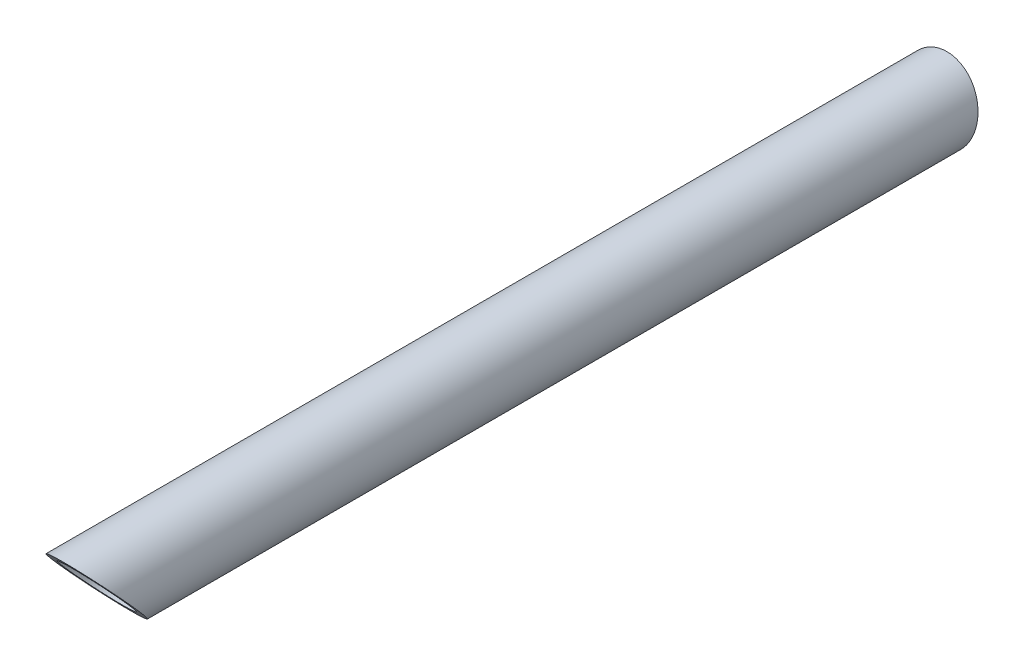
ISO-10303-21;
HEADER;
FILE_DESCRIPTION(('STEP AP214'),'2;1');
FILE_NAME('part.step','',(''),(''),'','','');
FILE_SCHEMA(('AUTOMOTIVE_DESIGN { 1 0 10303 214 1 1 1 1 }'));
ENDSEC;
DATA;
#1=APPLICATION_CONTEXT('core data for automotive mechanical design processes');
#2=APPLICATION_PROTOCOL_DEFINITION('international standard','automotive_design',2000,#1);
#3=PRODUCT_CONTEXT('',#1,'mechanical');
#4=PRODUCT('Part','Part','',(#3));
#5=PRODUCT_RELATED_PRODUCT_CATEGORY('part','',(#4));
#6=PRODUCT_DEFINITION_FORMATION('','',#4);
#7=PRODUCT_DEFINITION_CONTEXT('part definition',#1,'design');
#8=PRODUCT_DEFINITION('design','',#6,#7);
#9=PRODUCT_DEFINITION_SHAPE('','',#8);
#10=(LENGTH_UNIT() NAMED_UNIT(*) SI_UNIT(.MILLI.,.METRE.));
#11=(NAMED_UNIT(*) PLANE_ANGLE_UNIT() SI_UNIT($,.RADIAN.));
#12=(NAMED_UNIT(*) SI_UNIT($,.STERADIAN.) SOLID_ANGLE_UNIT());
#13=UNCERTAINTY_MEASURE_WITH_UNIT(LENGTH_MEASURE(1.E-05),#10,'distance_accuracy_value','');
#14=(GEOMETRIC_REPRESENTATION_CONTEXT(3) GLOBAL_UNCERTAINTY_ASSIGNED_CONTEXT((#13)) GLOBAL_UNIT_ASSIGNED_CONTEXT((#10,
#11,#12)) REPRESENTATION_CONTEXT('',''));
#15=CARTESIAN_POINT('',(0.,0.,0.));
#16=DIRECTION('',(0.,0.,1.));
#17=DIRECTION('',(1.,0.,0.));
#18=AXIS2_PLACEMENT_3D('',#15,#16,#17);
#19=CARTESIAN_POINT('',(0.,0.,0.));
#20=DIRECTION('',(0.,0.,1.));
#21=DIRECTION('',(-1.,0.,0.));
#22=AXIS2_PLACEMENT_3D('',#19,#20,#21);
#23=CYLINDRICAL_SURFACE('',#22,10.65);
#24=CARTESIAN_POINT('',(0.,0.,236.37445000171));
#25=DIRECTION('',(0.,0.66412219582778,-0.747624042556744));
#26=DIRECTION('',(0.,-0.747624042556744,-0.66412219582778));
#27=AXIS2_PLACEMENT_3D('',#24,#25,#26);
#28=ELLIPSE('',#27,14.2451277564307,10.65);
#29=CARTESIAN_POINT('',(0.,10.65,245.834955527158));
#30=VERTEX_POINT('',#29);
#31=EDGE_CURVE('E11',#30,#30,#28,.T.);
#32=ORIENTED_EDGE('',*,*,#31,.T.);
#33=EDGE_LOOP('',(#32));
#34=FACE_BOUND('',#33,.T.);
#35=CARTESIAN_POINT('',(0.,0.,0.));
#36=DIRECTION('',(-0.00211206155957193,0.196299401175255,0.980541730011632));
#37=DIRECTION('',(-0.0105494190073639,0.980484979004172,-0.196310763092081));
#38=AXIS2_PLACEMENT_3D('',#35,#36,#37);
#39=ELLIPSE('',#38,10.8613429434295,10.65);
#40=CARTESIAN_POINT('',(0.114580857692914,-10.6493836078456,2.13219852142941));
#41=VERTEX_POINT('',#40);
#42=EDGE_CURVE('E50',#41,#41,#39,.T.);
#43=ORIENTED_EDGE('',*,*,#42,.T.);
#44=EDGE_LOOP('',(#43));
#45=FACE_BOUND('',#44,.T.);
#46=ADVANCED_FACE('F16',(#34,#45),#23,.T.);
#47=CARTESIAN_POINT('',(0.,0.,0.));
#48=DIRECTION('',(0.,0.,1.));
#49=DIRECTION('',(-1.,0.,0.));
#50=AXIS2_PLACEMENT_3D('',#47,#48,#49);
#51=CYLINDRICAL_SURFACE('',#50,8.35);
#52=CARTESIAN_POINT('',(0.,0.,236.37445000171));
#53=DIRECTION('',(0.,-0.66412219582778,0.747624042556744));
#54=DIRECTION('',(0.,-0.747624042556744,-0.66412219582778));
#55=AXIS2_PLACEMENT_3D('',#52,#53,#54);
#56=ELLIPSE('',#55,11.1687151893142,8.35);
#57=CARTESIAN_POINT('',(0.,8.35,243.791841657812));
#58=VERTEX_POINT('',#57);
#59=EDGE_CURVE('E25',#58,#58,#56,.T.);
#60=ORIENTED_EDGE('',*,*,#59,.T.);
#61=EDGE_LOOP('',(#60));
#62=FACE_BOUND('',#61,.T.);
#63=CARTESIAN_POINT('',(0.,0.,0.));
#64=DIRECTION('',(0.00211206155957193,-0.196299401175255,-0.980541730011632));
#65=DIRECTION('',(-0.0105494190073641,0.980484979004172,-0.196310763092081));
#66=AXIS2_PLACEMENT_3D('',#63,#64,#65);
#67=ELLIPSE('',#66,8.51570080541187,8.35);
#68=CARTESIAN_POINT('',(0.0898356959376365,-8.34951672540006,1.67172372337423));
#69=VERTEX_POINT('',#68);
#70=EDGE_CURVE('E43',#69,#69,#67,.T.);
#71=ORIENTED_EDGE('',*,*,#70,.T.);
#72=EDGE_LOOP('',(#71));
#73=FACE_BOUND('',#72,.T.);
#74=ADVANCED_FACE('F80',(#62,#73),#51,.F.);
#75=CARTESIAN_POINT('',(2.57047442284068E-13,-117.363157671558,132.119539049992));
#76=DIRECTION('',(0.,0.66412219582778,-0.747624042556744));
#77=DIRECTION('',(-1.,0.,0.));
#78=AXIS2_PLACEMENT_3D('',#75,#76,#77);
#79=PLANE('',#78);
#80=ORIENTED_EDGE('',*,*,#31,.F.);
#81=EDGE_LOOP('',(#80));
#82=FACE_BOUND('',#81,.T.);
#83=ORIENTED_EDGE('',*,*,#59,.F.);
#84=EDGE_LOOP('',(#83));
#85=FACE_BOUND('',#84,.T.);
#86=ADVANCED_FACE('F74',(#82,#85),#79,.F.);
#87=CARTESIAN_POINT('',(0.,0.,0.));
#88=DIRECTION('',(-0.00211206155957193,0.196299401175255,0.980541730011632));
#89=DIRECTION('',(0.999942122802403,0.0107587659805553,0.));
#90=AXIS2_PLACEMENT_3D('',#87,#88,#89);
#91=PLANE('',#90);
#92=ORIENTED_EDGE('',*,*,#42,.F.);
#93=EDGE_LOOP('',(#92));
#94=FACE_BOUND('',#93,.T.);
#95=ORIENTED_EDGE('',*,*,#70,.F.);
#96=EDGE_LOOP('',(#95));
#97=FACE_BOUND('',#96,.T.);
#98=ADVANCED_FACE('F79',(#94,#97),#91,.F.);
#99=CLOSED_SHELL('',(#46,#74,#86,#98));
#100=MANIFOLD_SOLID_BREP('B1',#99);
#101=ADVANCED_BREP_SHAPE_REPRESENTATION('',(#18,#100),#14);
#102=SHAPE_DEFINITION_REPRESENTATION(#9,#101);
ENDSEC;
END-ISO-10303-21;
